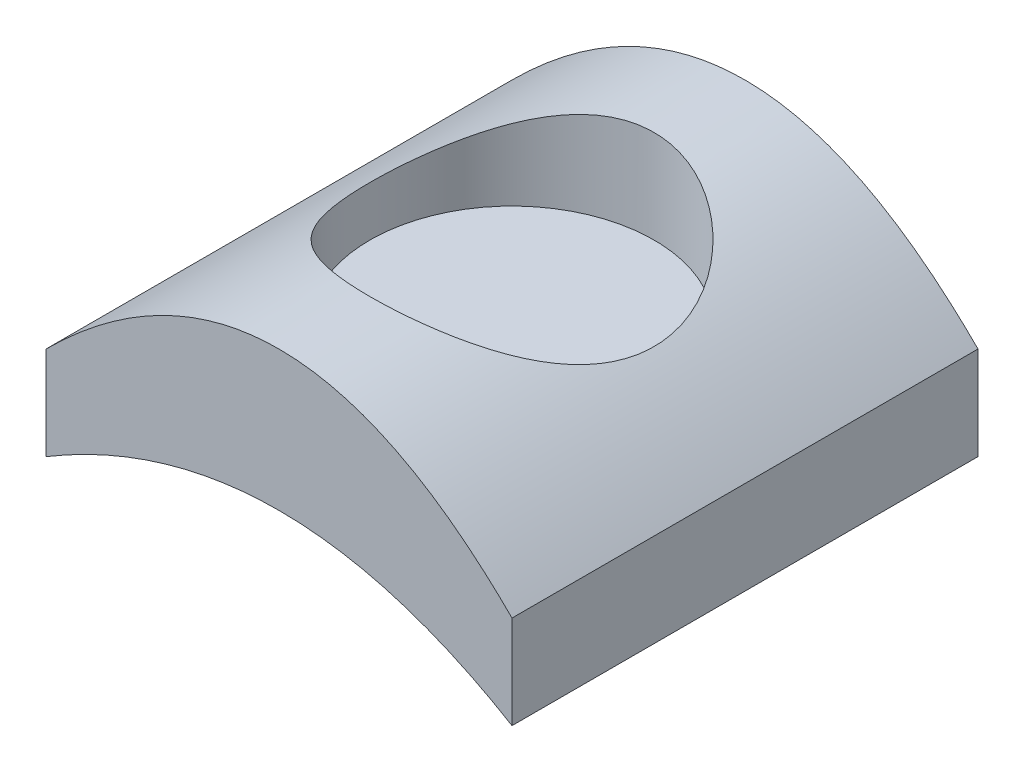
ISO-10303-21;
HEADER;
FILE_DESCRIPTION(('STEP AP214'),'2;1');
FILE_NAME('part.step','',(''),(''),'','','');
FILE_SCHEMA(('AUTOMOTIVE_DESIGN { 1 0 10303 214 1 1 1 1 }'));
ENDSEC;
DATA;
#1=APPLICATION_CONTEXT('core data for automotive mechanical design processes');
#2=APPLICATION_PROTOCOL_DEFINITION('international standard','automotive_design',2000,#1);
#3=PRODUCT_CONTEXT('',#1,'mechanical');
#4=PRODUCT('Part','Part','',(#3));
#5=PRODUCT_RELATED_PRODUCT_CATEGORY('part','',(#4));
#6=PRODUCT_DEFINITION_FORMATION('','',#4);
#7=PRODUCT_DEFINITION_CONTEXT('part definition',#1,'design');
#8=PRODUCT_DEFINITION('design','',#6,#7);
#9=PRODUCT_DEFINITION_SHAPE('','',#8);
#10=(LENGTH_UNIT() NAMED_UNIT(*) SI_UNIT(.MILLI.,.METRE.));
#11=(NAMED_UNIT(*) PLANE_ANGLE_UNIT() SI_UNIT($,.RADIAN.));
#12=(NAMED_UNIT(*) SI_UNIT($,.STERADIAN.) SOLID_ANGLE_UNIT());
#13=UNCERTAINTY_MEASURE_WITH_UNIT(LENGTH_MEASURE(1.E-05),#10,'distance_accuracy_value','');
#14=(GEOMETRIC_REPRESENTATION_CONTEXT(3) GLOBAL_UNCERTAINTY_ASSIGNED_CONTEXT((#13)) GLOBAL_UNIT_ASSIGNED_CONTEXT((#10,
#11,#12)) REPRESENTATION_CONTEXT('',''));
#15=CARTESIAN_POINT('',(0.,0.,0.));
#16=DIRECTION('',(0.,0.,1.));
#17=DIRECTION('',(1.,0.,0.));
#18=AXIS2_PLACEMENT_3D('',#15,#16,#17);
#19=CARTESIAN_POINT('',(-5.,0.,10.));
#20=DIRECTION('',(-1.,0.,0.));
#21=DIRECTION('',(0.,0.,1.));
#22=AXIS2_PLACEMENT_3D('',#19,#20,#21);
#23=PLANE('',#22);
#24=DIRECTION('',(0.,1.,0.));
#25=VECTOR('',#24,1.);
#26=CARTESIAN_POINT('',(-5.,0.,0.));
#27=LINE('',#26,#25);
#28=CARTESIAN_POINT('',(-5.,0.,0.));
#29=VERTEX_POINT('',#28);
#30=CARTESIAN_POINT('',(-5.,2.,0.));
#31=VERTEX_POINT('',#30);
#32=EDGE_CURVE('E143',#29,#31,#27,.T.);
#33=ORIENTED_EDGE('',*,*,#32,.F.);
#34=DIRECTION('',(0.,0.,-1.));
#35=VECTOR('',#34,1.);
#36=CARTESIAN_POINT('',(-5.,0.,10.));
#37=LINE('',#36,#35);
#38=CARTESIAN_POINT('',(-5.,0.,10.));
#39=VERTEX_POINT('',#38);
#40=EDGE_CURVE('E58',#39,#29,#37,.T.);
#41=ORIENTED_EDGE('',*,*,#40,.F.);
#42=DIRECTION('',(0.,1.,0.));
#43=VECTOR('',#42,1.);
#44=CARTESIAN_POINT('',(-5.,0.,10.));
#45=LINE('',#44,#43);
#46=CARTESIAN_POINT('',(-5.,2.,10.));
#47=VERTEX_POINT('',#46);
#48=EDGE_CURVE('E115',#39,#47,#45,.T.);
#49=ORIENTED_EDGE('',*,*,#48,.T.);
#50=DIRECTION('',(0.,0.,-1.));
#51=VECTOR('',#50,1.);
#52=CARTESIAN_POINT('',(-5.,2.,10.));
#53=LINE('',#52,#51);
#54=EDGE_CURVE('E90',#47,#31,#53,.T.);
#55=ORIENTED_EDGE('',*,*,#54,.T.);
#56=EDGE_LOOP('',(#33,#41,#49,#55));
#57=FACE_BOUND('',#56,.T.);
#58=ADVANCED_FACE('F45',(#57),#23,.T.);
#59=CARTESIAN_POINT('',(-5.,0.,10.));
#60=CARTESIAN_POINT('',(0.,3.,10.));
#61=CARTESIAN_POINT('',(5.,0.,10.));
#62=B_SPLINE_CURVE_WITH_KNOTS('',2,(#59,#60,#61),.UNSPECIFIED.,.F.,.F.,(3,3),(0.,1.),.UNSPECIFIED.);
#63=DIRECTION('',(0.,0.,-1.));
#64=VECTOR('',#63,1.);
#65=SURFACE_OF_LINEAR_EXTRUSION('',#62,#64);
#66=CARTESIAN_POINT('',(-5.,0.,0.));
#67=CARTESIAN_POINT('',(0.,3.,0.));
#68=CARTESIAN_POINT('',(5.,0.,0.));
#69=B_SPLINE_CURVE_WITH_KNOTS('',2,(#66,#67,#68),.UNSPECIFIED.,.F.,.F.,(3,3),(0.,1.),.UNSPECIFIED.);
#70=CARTESIAN_POINT('',(5.,0.,0.));
#71=VERTEX_POINT('',#70);
#72=EDGE_CURVE('E82',#29,#71,#69,.T.);
#73=ORIENTED_EDGE('',*,*,#72,.T.);
#74=DIRECTION('',(0.,0.,-1.));
#75=VECTOR('',#74,1.);
#76=CARTESIAN_POINT('',(5.,0.,10.));
#77=LINE('',#76,#75);
#78=CARTESIAN_POINT('',(5.,0.,10.));
#79=VERTEX_POINT('',#78);
#80=EDGE_CURVE('E111',#79,#71,#77,.T.);
#81=ORIENTED_EDGE('',*,*,#80,.F.);
#82=EDGE_CURVE('E100',#39,#79,#62,.T.);
#83=ORIENTED_EDGE('',*,*,#82,.F.);
#84=ORIENTED_EDGE('',*,*,#40,.T.);
#85=EDGE_LOOP('',(#73,#81,#83,#84));
#86=FACE_BOUND('',#85,.T.);
#87=ADVANCED_FACE('F133',(#86),#65,.F.);
#88=CARTESIAN_POINT('',(5.,0.,10.));
#89=DIRECTION('',(-1.,0.,0.));
#90=DIRECTION('',(0.,0.,1.));
#91=AXIS2_PLACEMENT_3D('',#88,#89,#90);
#92=PLANE('',#91);
#93=DIRECTION('',(0.,1.,0.));
#94=VECTOR('',#93,1.);
#95=CARTESIAN_POINT('',(5.,0.,0.));
#96=LINE('',#95,#94);
#97=CARTESIAN_POINT('',(5.,2.,0.));
#98=VERTEX_POINT('',#97);
#99=EDGE_CURVE('E108',#71,#98,#96,.T.);
#100=ORIENTED_EDGE('',*,*,#99,.T.);
#101=DIRECTION('',(0.,0.,-1.));
#102=VECTOR('',#101,1.);
#103=CARTESIAN_POINT('',(5.,2.,10.));
#104=LINE('',#103,#102);
#105=CARTESIAN_POINT('',(5.,2.,10.));
#106=VERTEX_POINT('',#105);
#107=EDGE_CURVE('E105',#106,#98,#104,.T.);
#108=ORIENTED_EDGE('',*,*,#107,.F.);
#109=DIRECTION('',(0.,1.,0.));
#110=VECTOR('',#109,1.);
#111=CARTESIAN_POINT('',(5.,0.,10.));
#112=LINE('',#111,#110);
#113=EDGE_CURVE('E95',#79,#106,#112,.T.);
#114=ORIENTED_EDGE('',*,*,#113,.F.);
#115=ORIENTED_EDGE('',*,*,#80,.T.);
#116=EDGE_LOOP('',(#100,#108,#114,#115));
#117=FACE_BOUND('',#116,.T.);
#118=ADVANCED_FACE('F106',(#117),#92,.F.);
#119=CARTESIAN_POINT('',(-5.,2.,10.));
#120=CARTESIAN_POINT('',(0.,7.,10.));
#121=CARTESIAN_POINT('',(5.,2.,10.));
#122=B_SPLINE_CURVE_WITH_KNOTS('',2,(#119,#120,#121),.UNSPECIFIED.,.F.,.F.,(3,3),(0.,1.),.UNSPECIFIED.);
#123=DIRECTION('',(0.,0.,-1.));
#124=VECTOR('',#123,1.);
#125=SURFACE_OF_LINEAR_EXTRUSION('',#122,#124);
#126=CARTESIAN_POINT('',(0.,4.5,8.05));
#127=CARTESIAN_POINT('',(0.0784981627811624,4.50000118881756,8.05000107052331));
#128=CARTESIAN_POINT('',(0.156984381436702,4.4981468757126,8.04696641545126));
#129=CARTESIAN_POINT('',(0.313344893907485,4.49079264288075,8.03487461933537));
#130=CARTESIAN_POINT('',(0.391219006871041,4.48529168387333,8.02581576141378));
#131=CARTESIAN_POINT('',(0.545797864046334,4.47080828546393,8.0017873598041));
#132=CARTESIAN_POINT('',(0.622501403762512,4.46182248225641,7.98681210495026));
#133=CARTESIAN_POINT('',(0.774129696151562,4.44064859686891,7.95115232565735));
#134=CARTESIAN_POINT('',(0.849053678459514,4.42845915443242,7.93046537585917));
#135=CARTESIAN_POINT('',(1.06958492650072,4.38774441005437,7.86044420563808));
#136=CARTESIAN_POINT('',(1.21192522488419,4.35497447033855,7.80299446472553));
#137=CARTESIAN_POINT('',(1.48466029895329,4.2814468567469,7.66860736065212));
#138=CARTESIAN_POINT('',(1.6150530766105,4.2406878503945,7.59166674603002));
#139=CARTESIAN_POINT('',(1.8726919305698,4.1510993529252,7.41291074519257));
#140=CARTESIAN_POINT('',(1.99871892923861,4.10187793170382,7.30953248277669));
#141=CARTESIAN_POINT('',(2.23272809020309,4.00286487662458,7.08419670910744));
#142=CARTESIAN_POINT('',(2.3406956409399,3.95307281554009,6.96222430471919));
#143=CARTESIAN_POINT('',(2.5462679359484,3.85281131058824,6.68850592660449));
#144=CARTESIAN_POINT('',(2.64179075698352,3.80276218598049,6.53500820872939));
#145=CARTESIAN_POINT('',(2.76423366322628,3.73606695393813,6.29219144033967));
#146=CARTESIAN_POINT('',(2.80158276981249,3.71522644955823,6.20912973613281));
#147=CARTESIAN_POINT('',(2.86891030706698,3.67704896363647,6.03931601264878));
#148=CARTESIAN_POINT('',(2.89889344937839,3.65970974376662,5.95256639422911));
#149=CARTESIAN_POINT('',(2.94906377909079,3.63036027070587,5.78278515767898));
#150=CARTESIAN_POINT('',(2.96982408567049,3.61804423738577,5.69997532415984));
#151=CARTESIAN_POINT('',(3.00437815332188,3.59740114312916,5.53246437549448));
#152=CARTESIAN_POINT('',(3.01817579030531,3.58907186301862,5.44776434005136));
#153=CARTESIAN_POINT('',(3.03858581866402,3.57671007755852,5.27724518751935));
#154=CARTESIAN_POINT('',(3.04520283086156,3.57267480899106,5.19142682611807));
#155=CARTESIAN_POINT('',(3.05115110140926,3.56904862783127,5.01944928146467));
#156=CARTESIAN_POINT('',(3.05048316056715,3.56945722674114,4.93329013671443));
#157=CARTESIAN_POINT('',(3.04243928845498,3.57435760712608,4.77273225481908));
#158=CARTESIAN_POINT('',(3.03595317395457,3.57830771867144,4.69827086499934));
#159=CARTESIAN_POINT('',(3.01758168533365,3.58942806664018,4.55025344495237));
#160=CARTESIAN_POINT('',(3.00569464687283,3.59659929567035,4.47669770098935));
#161=CARTESIAN_POINT('',(2.96213102094858,3.6226658443988,4.25818817680387));
#162=CARTESIAN_POINT('',(2.92254524089543,3.64611841855216,4.11526470021434));
#163=CARTESIAN_POINT('',(2.82329781561104,3.70314594589275,3.83649373117727));
#164=CARTESIAN_POINT('',(2.76335729109389,3.73686079805631,3.70077658650036));
#165=CARTESIAN_POINT('',(2.62549537970158,3.81115254652711,3.44085553968964));
#166=CARTESIAN_POINT('',(2.54756674312895,3.8517322077726,3.31665630795391));
#167=CARTESIAN_POINT('',(2.3639132610353,3.94214248993975,3.06564476497376));
#168=CARTESIAN_POINT('',(2.25586236803968,3.99248393964299,2.94071527605169));
#169=CARTESIAN_POINT('',(2.02097691375801,4.09294835112973,2.70972775237863));
#170=CARTESIAN_POINT('',(1.89412557911884,4.14307107623599,2.60368675749145));
#171=CARTESIAN_POINT('',(1.61199589149662,4.24229019767436,2.40459075761656));
#172=CARTESIAN_POINT('',(1.45522082901613,4.29094146793183,2.31339189570167));
#173=CARTESIAN_POINT('',(1.2080081423557,4.35475465350222,2.19794450092876));
#174=CARTESIAN_POINT('',(1.12358806853762,4.37449968529579,2.1630185094695));
#175=CARTESIAN_POINT('',(0.951225482177575,4.41025775149912,2.10068052784847));
#176=CARTESIAN_POINT('',(0.863283528344455,4.42627137513042,2.07326735122785));
#177=CARTESIAN_POINT('',(0.692690269662221,4.45267908656631,2.0285114006533));
#178=CARTESIAN_POINT('',(0.610276113824449,4.46344947580334,2.01048386137294));
#179=CARTESIAN_POINT('',(0.443825729024834,4.48099398951751,1.98128267894938));
#180=CARTESIAN_POINT('',(0.359789738907607,4.48776869786304,1.9701080344183));
#181=CARTESIAN_POINT('',(0.190904645962485,4.49706808704227,1.95480055081778));
#182=CARTESIAN_POINT('',(0.106056170010532,4.49959581471546,1.95066266346078));
#183=CARTESIAN_POINT('',(-0.063706557549648,4.50031451080646,1.94948434565458));
#184=CARTESIAN_POINT('',(-0.148620805171852,4.49850572417649,1.95244351432127));
#185=CARTESIAN_POINT('',(-0.307196586831512,4.49111129781114,1.96460149601649));
#186=CARTESIAN_POINT('',(-0.380945652734081,4.48602273018247,1.97297955743518));
#187=CARTESIAN_POINT('',(-0.527370311121344,4.47272537568708,1.99502557229634));
#188=CARTESIAN_POINT('',(-0.600045567315385,4.46451563199575,2.00869514792351));
#189=CARTESIAN_POINT('',(-0.815704907543157,4.4355209531159,2.05741690858986));
#190=CARTESIAN_POINT('',(-0.956443805006223,4.41036437079833,2.10019173046627));
#191=CARTESIAN_POINT('',(-1.23245755494868,4.35007217085316,2.20606329143215));
#192=CARTESIAN_POINT('',(-1.367457849734,4.31466973467372,2.26971042598607));
#193=CARTESIAN_POINT('',(-1.62551863757532,4.23743485348166,2.41501989659884));
#194=CARTESIAN_POINT('',(-1.74856970581819,4.19559739905418,2.49669628948552));
#195=CARTESIAN_POINT('',(-1.93082405245036,4.12763001123036,2.63749997780206));
#196=CARTESIAN_POINT('',(-1.99469792202282,4.10249694480052,2.6911853045896));
#197=CARTESIAN_POINT('',(-2.11770830324508,4.05190880764803,2.8034717504815));
#198=CARTESIAN_POINT('',(-2.17684922646853,4.02645406300859,2.86206818511861));
#199=CARTESIAN_POINT('',(-2.3469994969506,3.95044677372796,3.04504129122263));
#200=CARTESIAN_POINT('',(-2.45066365470871,3.90027942789026,3.17654547779975));
#201=CARTESIAN_POINT('',(-2.64257526567557,3.80266889107887,3.46651357625255));
#202=CARTESIAN_POINT('',(-2.7291823862887,3.75567959138599,3.62623499398056));
#203=CARTESIAN_POINT('',(-2.83732115610627,3.69508904488855,3.87730862779031));
#204=CARTESIAN_POINT('',(-2.86973896197475,3.67654096952207,3.96291594354231));
#205=CARTESIAN_POINT('',(-2.92692107951018,3.64339564864206,4.13741767310668));
#206=CARTESIAN_POINT('',(-2.95168661020437,3.62879777389743,4.22631156083081));
#207=CARTESIAN_POINT('',(-2.99102275515903,3.60541274050059,4.39735500236828));
#208=CARTESIAN_POINT('',(-3.00637671730207,3.59618414436986,4.47926512329331));
#209=CARTESIAN_POINT('',(-3.03034891310323,3.58171303908274,4.64441092738807));
#210=CARTESIAN_POINT('',(-3.03896805418791,3.57646999292968,4.7276464304378));
#211=CARTESIAN_POINT('',(-3.04932761681985,3.57016279818556,4.89465551017126));
#212=CARTESIAN_POINT('',(-3.05107191132169,3.56909629673428,4.9784287572635));
#213=CARTESIAN_POINT('',(-3.04766342461538,3.5711750685325,5.1457779344623));
#214=CARTESIAN_POINT('',(-3.04251113571531,3.57432004114871,5.22935387822661));
#215=CARTESIAN_POINT('',(-3.02638873010037,3.5841027428565,5.38590871247471));
#216=CARTESIAN_POINT('',(-3.01616192905132,3.59029352420284,5.45899336725413));
#217=CARTESIAN_POINT('',(-2.99051726422653,3.60569672920026,5.60392952440888));
#218=CARTESIAN_POINT('',(-2.97509782490419,3.61491006993223,5.6757806455438));
#219=CARTESIAN_POINT('',(-2.9213000804348,3.64673197488838,5.88876538401138));
#220=CARTESIAN_POINT('',(-2.87537004250834,3.67353028109087,6.02744677933307));
#221=CARTESIAN_POINT('',(-2.76278582526637,3.73702983854406,6.30090925104991));
#222=CARTESIAN_POINT('',(-2.69532126161878,3.77410925530675,6.43526224520077));
#223=CARTESIAN_POINT('',(-2.54242367321906,3.85419214426024,6.69140179237723));
#224=CARTESIAN_POINT('',(-2.45698174825737,3.89719854712395,6.81318207623796));
#225=CARTESIAN_POINT('',(-2.25686929292007,3.99179043192688,7.05851482014255));
#226=CARTESIAN_POINT('',(-2.1397869690595,4.04373757726182,7.17996162825493));
#227=CARTESIAN_POINT('',(-1.88654098112843,4.14569658081064,7.40247038870613));
#228=CARTESIAN_POINT('',(-1.7503586087512,4.19570647947114,7.5035121148283));
#229=CARTESIAN_POINT('',(-1.52944917517444,4.2666655505127,7.64034023966894));
#230=CARTESIAN_POINT('',(-1.45062285943094,4.29022559567058,7.68447572679902));
#231=CARTESIAN_POINT('',(-1.28874972121601,4.3345662980718,7.76583049153618));
#232=CARTESIAN_POINT('',(-1.20570502519742,4.35534833687101,7.80305321060827));
#233=CARTESIAN_POINT('',(-1.03609548943958,4.39336818755947,7.8700703107198));
#234=CARTESIAN_POINT('',(-0.949538512563524,4.41061344383152,7.8998803230821));
#235=CARTESIAN_POINT('',(-0.773462212426529,4.44094998154303,7.95172360290182));
#236=CARTESIAN_POINT('',(-0.683944587587135,4.45404360050722,7.97376124727661));
#237=CARTESIAN_POINT('',(-0.496147246924665,4.4763276819093,8.01100506221415));
#238=CARTESIAN_POINT('',(-0.397703003893757,4.48516607092206,8.02559964677985));
#239=CARTESIAN_POINT('',(-0.199499388694212,4.49700139421183,8.04509630200057));
#240=CARTESIAN_POINT('',(-0.0997400528478955,4.49999848948406,8.04999863978916));
#241=CARTESIAN_POINT('',(0.,4.5,8.05));
#242=B_SPLINE_CURVE_WITH_KNOTS('',3,(#126,#127,#128,#129,#130,#131,#132,#133,#134,#135,#136,
#137,#138,#139,#140,#141,#142,#143,#144,#145,#146,#147,#148,#149,#150,#151,#152,#153,#154,#155,
#156,#157,#158,#159,#160,#161,#162,#163,#164,#165,#166,#167,#168,#169,#170,#171,#172,#173,#174,
#175,#176,#177,#178,#179,#180,#181,#182,#183,#184,#185,#186,#187,#188,#189,#190,#191,#192,#193,
#194,#195,#196,#197,#198,#199,#200,#201,#202,#203,#204,#205,#206,#207,#208,#209,#210,#211,#212,
#213,#214,#215,#216,#217,#218,#219,#220,#221,#222,#223,#224,#225,#226,#227,#228,#229,#230,#231,
#232,#233,#234,#235,#236,#237,#238,#239,#240,#241),.UNSPECIFIED.,.T.,.F.,(4,2,2,2,2,2,2,2,2,2,2,
2,2,2,2,2,2,2,2,2,2,2,2,2,2,2,2,2,2,2,2,2,2,2,2,2,2,2,2,2,2,2,2,2,2,2,2,2,2,2,2,2,2,2,2,2,2,4),
(0.,0.235393638035736,0.470854391241718,0.706542994954142,0.942331833533654,1.41097471853523,
1.87969583393328,2.38843418629296,2.89758217888258,3.45710077183452,3.73703399144213,
4.01678768264809,4.27518328256791,4.53343488220244,4.79152019495737,5.04957713764174,
5.27384333686194,5.49817869252636,5.94647129251959,6.40117185730685,6.8560559997249,
7.37193692103749,7.888280902269,8.44828380626634,8.72833168192576,9.00833530559658,
9.26311264993501,9.51785275573603,9.77241002949546,10.0269529246787,10.2498764571062,
10.4728683839255,10.9184913931159,11.3769634030973,11.8357941393839,12.096980656203,
12.3579208150242,12.8800864570741,13.4397263517671,13.7195515265384,13.9993321014258,
14.2505136814028,14.5016614122011,14.7526676383285,15.0036559474965,15.2255611651625,
15.4475337739067,15.8911312691761,16.3539138324075,16.8169260508359,17.3442835092881,
17.8721611641069,18.1519221474979,18.4315434786113,18.7105700686829,18.9894392763815,
19.2885395379445,19.5876315557181),.UNSPECIFIED.);
#243=CARTESIAN_POINT('',(0.,4.5,8.05));
#244=VERTEX_POINT('',#243);
#245=EDGE_CURVE('E11',#244,#244,#242,.T.);
#246=ORIENTED_EDGE('',*,*,#245,.F.);
#247=EDGE_LOOP('',(#246));
#248=FACE_BOUND('',#247,.T.);
#249=CARTESIAN_POINT('',(-5.,2.,0.));
#250=CARTESIAN_POINT('',(0.,7.,0.));
#251=CARTESIAN_POINT('',(5.,2.,0.));
#252=B_SPLINE_CURVE_WITH_KNOTS('',2,(#249,#250,#251),.UNSPECIFIED.,.F.,.F.,(3,3),(0.,1.),.UNSPECIFIED.);
#253=EDGE_CURVE('E150',#31,#98,#252,.T.);
#254=ORIENTED_EDGE('',*,*,#253,.F.);
#255=ORIENTED_EDGE('',*,*,#54,.F.);
#256=EDGE_CURVE('E99',#47,#106,#122,.T.);
#257=ORIENTED_EDGE('',*,*,#256,.T.);
#258=ORIENTED_EDGE('',*,*,#107,.T.);
#259=EDGE_LOOP('',(#254,#255,#257,#258));
#260=FACE_BOUND('',#259,.T.);
#261=ADVANCED_FACE('F113',(#248,#260),#125,.T.);
#262=CARTESIAN_POINT('',(0.,4.5,10.));
#263=DIRECTION('',(0.,0.,1.));
#264=DIRECTION('',(1.,0.,0.));
#265=AXIS2_PLACEMENT_3D('',#262,#263,#264);
#266=PLANE('',#265);
#267=ORIENTED_EDGE('',*,*,#48,.F.);
#268=ORIENTED_EDGE('',*,*,#82,.T.);
#269=ORIENTED_EDGE('',*,*,#113,.T.);
#270=ORIENTED_EDGE('',*,*,#256,.F.);
#271=EDGE_LOOP('',(#267,#268,#269,#270));
#272=FACE_BOUND('',#271,.T.);
#273=ADVANCED_FACE('F98',(#272),#266,.T.);
#274=CARTESIAN_POINT('',(0.,4.5,0.));
#275=DIRECTION('',(0.,0.,1.));
#276=DIRECTION('',(1.,0.,0.));
#277=AXIS2_PLACEMENT_3D('',#274,#275,#276);
#278=PLANE('',#277);
#279=ORIENTED_EDGE('',*,*,#32,.T.);
#280=ORIENTED_EDGE('',*,*,#253,.T.);
#281=ORIENTED_EDGE('',*,*,#99,.F.);
#282=ORIENTED_EDGE('',*,*,#72,.F.);
#283=EDGE_LOOP('',(#279,#280,#281,#282));
#284=FACE_BOUND('',#283,.T.);
#285=ADVANCED_FACE('F136',(#284),#278,.F.);
#286=CARTESIAN_POINT('',(0.,2.5,5.));
#287=DIRECTION('',(0.,1.,0.));
#288=DIRECTION('',(0.,0.,1.));
#289=AXIS2_PLACEMENT_3D('',#286,#287,#288);
#290=CYLINDRICAL_SURFACE('',#289,3.05);
#291=ORIENTED_EDGE('',*,*,#245,.T.);
#292=EDGE_LOOP('',(#291));
#293=FACE_BOUND('',#292,.T.);
#294=CARTESIAN_POINT('',(0.,2.5,5.));
#295=DIRECTION('',(0.,1.,0.));
#296=DIRECTION('',(0.,0.,1.));
#297=AXIS2_PLACEMENT_3D('',#294,#295,#296);
#298=CIRCLE('',#297,3.05);
#299=CARTESIAN_POINT('',(0.,2.5,8.05));
#300=VERTEX_POINT('',#299);
#301=EDGE_CURVE('E151',#300,#300,#298,.T.);
#302=ORIENTED_EDGE('',*,*,#301,.F.);
#303=EDGE_LOOP('',(#302));
#304=FACE_BOUND('',#303,.T.);
#305=ADVANCED_FACE('F174',(#293,#304),#290,.F.);
#306=CARTESIAN_POINT('',(0.,2.5,5.));
#307=DIRECTION('',(0.,1.,0.));
#308=DIRECTION('',(0.,0.,1.));
#309=AXIS2_PLACEMENT_3D('',#306,#307,#308);
#310=PLANE('',#309);
#311=ORIENTED_EDGE('',*,*,#301,.T.);
#312=EDGE_LOOP('',(#311));
#313=FACE_BOUND('',#312,.T.);
#314=ADVANCED_FACE('F179',(#313),#310,.T.);
#315=CLOSED_SHELL('',(#58,#87,#118,#261,#273,#285,#305,#314));
#316=MANIFOLD_SOLID_BREP('B2',#315);
#317=ADVANCED_BREP_SHAPE_REPRESENTATION('',(#18,#316),#14);
#318=SHAPE_DEFINITION_REPRESENTATION(#9,#317);
ENDSEC;
END-ISO-10303-21;
